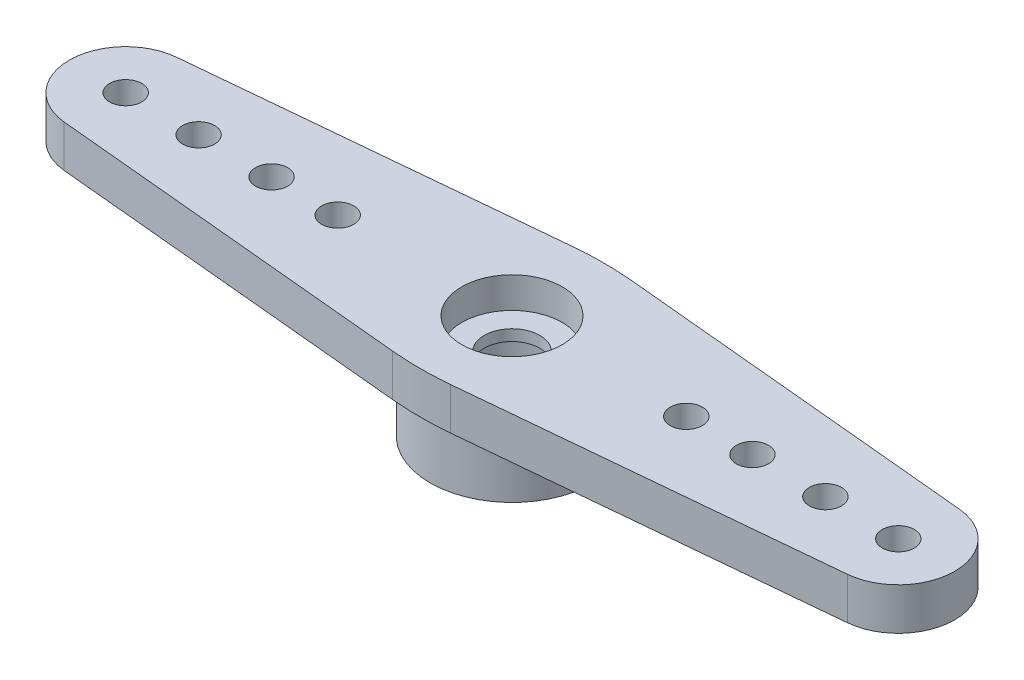
ISO-10303-21;
HEADER;
FILE_DESCRIPTION(('STEP AP214'),'2;1');
FILE_NAME('part.step','',(''),(''),'','','');
FILE_SCHEMA(('AUTOMOTIVE_DESIGN { 1 0 10303 214 1 1 1 1 }'));
ENDSEC;
DATA;
#1=APPLICATION_CONTEXT('core data for automotive mechanical design processes');
#2=APPLICATION_PROTOCOL_DEFINITION('international standard','automotive_design',2000,#1);
#3=PRODUCT_CONTEXT('',#1,'mechanical');
#4=PRODUCT('Part','Part','',(#3));
#5=PRODUCT_RELATED_PRODUCT_CATEGORY('part','',(#4));
#6=PRODUCT_DEFINITION_FORMATION('','',#4);
#7=PRODUCT_DEFINITION_CONTEXT('part definition',#1,'design');
#8=PRODUCT_DEFINITION('design','',#6,#7);
#9=PRODUCT_DEFINITION_SHAPE('','',#8);
#10=(LENGTH_UNIT() NAMED_UNIT(*) SI_UNIT(.MILLI.,.METRE.));
#11=(NAMED_UNIT(*) PLANE_ANGLE_UNIT() SI_UNIT($,.RADIAN.));
#12=(NAMED_UNIT(*) SI_UNIT($,.STERADIAN.) SOLID_ANGLE_UNIT());
#13=UNCERTAINTY_MEASURE_WITH_UNIT(LENGTH_MEASURE(1.E-05),#10,'distance_accuracy_value','');
#14=(GEOMETRIC_REPRESENTATION_CONTEXT(3) GLOBAL_UNCERTAINTY_ASSIGNED_CONTEXT((#13)) GLOBAL_UNIT_ASSIGNED_CONTEXT((#10,
#11,#12)) REPRESENTATION_CONTEXT('',''));
#15=CARTESIAN_POINT('',(0.,0.,0.));
#16=DIRECTION('',(0.,0.,1.));
#17=DIRECTION('',(1.,0.,0.));
#18=AXIS2_PLACEMENT_3D('',#15,#16,#17);
#19=CARTESIAN_POINT('',(0.,4.2672,0.));
#20=DIRECTION('',(0.,-1.,0.));
#21=DIRECTION('',(0.,0.,-1.));
#22=AXIS2_PLACEMENT_3D('',#19,#20,#21);
#23=CYLINDRICAL_SURFACE('',#22,1.143);
#24=CARTESIAN_POINT('',(0.,2.54,0.));
#25=DIRECTION('',(0.,1.,0.));
#26=DIRECTION('',(0.,0.,1.));
#27=AXIS2_PLACEMENT_3D('',#24,#25,#26);
#28=CIRCLE('',#27,1.143);
#29=CARTESIAN_POINT('',(0.,2.54,1.143));
#30=VERTEX_POINT('',#29);
#31=EDGE_CURVE('E198',#30,#30,#28,.T.);
#32=ORIENTED_EDGE('',*,*,#31,.F.);
#33=EDGE_LOOP('',(#32));
#34=FACE_BOUND('',#33,.T.);
#35=CARTESIAN_POINT('',(0.,2.9972,0.));
#36=DIRECTION('',(0.,1.,0.));
#37=DIRECTION('',(0.,0.,1.));
#38=AXIS2_PLACEMENT_3D('',#35,#36,#37);
#39=CIRCLE('',#38,1.143);
#40=CARTESIAN_POINT('',(0.,2.9972,1.143));
#41=VERTEX_POINT('',#40);
#42=EDGE_CURVE('E358',#41,#41,#39,.F.);
#43=ORIENTED_EDGE('',*,*,#42,.F.);
#44=EDGE_LOOP('',(#43));
#45=FACE_BOUND('',#44,.T.);
#46=ADVANCED_FACE('F36',(#34,#45),#23,.F.);
#47=CARTESIAN_POINT('',(0.,0.,0.));
#48=DIRECTION('',(0.,1.,0.));
#49=DIRECTION('',(0.,0.,1.));
#50=AXIS2_PLACEMENT_3D('',#47,#48,#49);
#51=PLANE('',#50);
#52=CARTESIAN_POINT('',(0.,0.,0.));
#53=DIRECTION('',(0.,1.,0.));
#54=DIRECTION('',(0.,0.,1.));
#55=AXIS2_PLACEMENT_3D('',#52,#53,#54);
#56=CIRCLE('',#55,3.3655);
#57=CARTESIAN_POINT('',(0.,0.,3.3655));
#58=VERTEX_POINT('',#57);
#59=EDGE_CURVE('E212',#58,#58,#56,.T.);
#60=ORIENTED_EDGE('',*,*,#59,.F.);
#61=EDGE_LOOP('',(#60));
#62=FACE_BOUND('',#61,.T.);
#63=CARTESIAN_POINT('',(0.,0.,0.));
#64=DIRECTION('',(0.,1.,0.));
#65=DIRECTION('',(0.,0.,1.));
#66=AXIS2_PLACEMENT_3D('',#63,#64,#65);
#67=CIRCLE('',#66,2.2352);
#68=CARTESIAN_POINT('',(0.,0.,2.2352));
#69=VERTEX_POINT('',#68);
#70=EDGE_CURVE('E209',#69,#69,#67,.T.);
#71=ORIENTED_EDGE('',*,*,#70,.T.);
#72=EDGE_LOOP('',(#71));
#73=FACE_BOUND('',#72,.T.);
#74=ADVANCED_FACE('F259',(#62,#73),#51,.F.);
#75=CARTESIAN_POINT('',(0.,2.54,0.));
#76=DIRECTION('',(0.,-1.,0.));
#77=DIRECTION('',(0.,0.,-1.));
#78=AXIS2_PLACEMENT_3D('',#75,#76,#77);
#79=CYLINDRICAL_SURFACE('',#78,3.3655);
#80=CARTESIAN_POINT('',(0.,2.54,0.));
#81=DIRECTION('',(0.,1.,0.));
#82=DIRECTION('',(0.,0.,1.));
#83=AXIS2_PLACEMENT_3D('',#80,#81,#82);
#84=CIRCLE('',#83,3.3655);
#85=CARTESIAN_POINT('',(0.,2.54,3.3655));
#86=VERTEX_POINT('',#85);
#87=EDGE_CURVE('E213',#86,#86,#84,.T.);
#88=ORIENTED_EDGE('',*,*,#87,.F.);
#89=EDGE_LOOP('',(#88));
#90=FACE_BOUND('',#89,.T.);
#91=ORIENTED_EDGE('',*,*,#59,.T.);
#92=EDGE_LOOP('',(#91));
#93=FACE_BOUND('',#92,.T.);
#94=ADVANCED_FACE('F265',(#90,#93),#79,.T.);
#95=CARTESIAN_POINT('',(0.,2.54,0.));
#96=DIRECTION('',(0.,-1.,0.));
#97=DIRECTION('',(0.,0.,-1.));
#98=AXIS2_PLACEMENT_3D('',#95,#96,#97);
#99=CYLINDRICAL_SURFACE('',#98,2.2352);
#100=CARTESIAN_POINT('',(0.,2.54,0.));
#101=DIRECTION('',(0.,1.,0.));
#102=DIRECTION('',(0.,0.,1.));
#103=AXIS2_PLACEMENT_3D('',#100,#101,#102);
#104=CIRCLE('',#103,2.2352);
#105=CARTESIAN_POINT('',(0.,2.54,2.2352));
#106=VERTEX_POINT('',#105);
#107=EDGE_CURVE('E121',#106,#106,#104,.T.);
#108=ORIENTED_EDGE('',*,*,#107,.T.);
#109=EDGE_LOOP('',(#108));
#110=FACE_BOUND('',#109,.T.);
#111=ORIENTED_EDGE('',*,*,#70,.F.);
#112=EDGE_LOOP('',(#111));
#113=FACE_BOUND('',#112,.T.);
#114=ADVANCED_FACE('F318',(#110,#113),#99,.F.);
#115=CARTESIAN_POINT('',(-29.0607200096115,2.54,0.));
#116=DIRECTION('',(0.,1.,0.));
#117=DIRECTION('',(0.,0.,1.));
#118=AXIS2_PLACEMENT_3D('',#115,#116,#117);
#119=PLANE('',#118);
#120=CARTESIAN_POINT('',(-9.8806,2.54,0.));
#121=DIRECTION('',(0.,1.,0.));
#122=DIRECTION('',(0.,0.,1.));
#123=AXIS2_PLACEMENT_3D('',#120,#121,#122);
#124=CIRCLE('',#123,0.6604);
#125=CARTESIAN_POINT('',(-9.8806,2.54,0.6604));
#126=VERTEX_POINT('',#125);
#127=EDGE_CURVE('E161',#126,#126,#124,.F.);
#128=ORIENTED_EDGE('',*,*,#127,.F.);
#129=EDGE_LOOP('',(#128));
#130=FACE_BOUND('',#129,.T.);
#131=DIRECTION('',(-0.995596740434201,0.,0.0937396950965555));
#132=VECTOR('',#131,1.);
#133=CARTESIAN_POINT('',(-29.162120546294,2.54,-1.07696151236052));
#134=LINE('',#133,#132);
#135=CARTESIAN_POINT('',(-1.19049412772623,2.54,-3.71060988156648));
#136=VERTEX_POINT('',#135);
#137=CARTESIAN_POINT('',(-16.09226517831,2.54,-2.30754434514137));
#138=VERTEX_POINT('',#137);
#139=EDGE_CURVE('E117',#136,#138,#134,.T.);
#140=ORIENTED_EDGE('',*,*,#139,.F.);
#141=CARTESIAN_POINT('',(0.,2.54,8.93346872194787));
#142=DIRECTION('',(0.,1.,0.));
#143=DIRECTION('',(0.,0.,1.));
#144=AXIS2_PLACEMENT_3D('',#141,#142,#143);
#145=CIRCLE('',#144,12.7);
#146=CARTESIAN_POINT('',(1.19049412772628,2.54,-3.71060988156648));
#147=VERTEX_POINT('',#146);
#148=EDGE_CURVE('E222',#136,#147,#145,.F.);
#149=ORIENTED_EDGE('',*,*,#148,.T.);
#150=DIRECTION('',(0.995596740434201,0.,0.0937396950965555));
#151=VECTOR('',#150,1.);
#152=CARTESIAN_POINT('',(-28.4485987983057,2.54,-6.50125736059801));
#153=LINE('',#152,#151);
#154=CARTESIAN_POINT('',(16.09226517831,2.54,-2.30754434514137));
#155=VERTEX_POINT('',#154);
#156=EDGE_CURVE('E175',#147,#155,#153,.T.);
#157=ORIENTED_EDGE('',*,*,#156,.T.);
#158=CARTESIAN_POINT('',(15.875,2.54,0.));
#159=DIRECTION('',(0.,1.,0.));
#160=DIRECTION('',(0.,0.,1.));
#161=AXIS2_PLACEMENT_3D('',#158,#159,#160);
#162=CIRCLE('',#161,2.31775);
#163=CARTESIAN_POINT('',(16.09226517831,2.54,2.30754434514137));
#164=VERTEX_POINT('',#163);
#165=EDGE_CURVE('E172',#164,#155,#162,.T.);
#166=ORIENTED_EDGE('',*,*,#165,.F.);
#167=DIRECTION('',(0.995596740434201,0.,-0.0937396950965555));
#168=VECTOR('',#167,1.);
#169=CARTESIAN_POINT('',(-28.4485987983057,2.54,6.50125736059801));
#170=LINE('',#169,#168);
#171=CARTESIAN_POINT('',(1.19049412772627,2.54,3.71060988156648));
#172=VERTEX_POINT('',#171);
#173=EDGE_CURVE('E170',#172,#164,#170,.T.);
#174=ORIENTED_EDGE('',*,*,#173,.F.);
#175=CARTESIAN_POINT('',(0.,2.54,-8.93346872194787));
#176=DIRECTION('',(0.,1.,0.));
#177=DIRECTION('',(0.,0.,1.));
#178=AXIS2_PLACEMENT_3D('',#175,#176,#177);
#179=CIRCLE('',#178,12.7);
#180=CARTESIAN_POINT('',(-1.19049412772624,2.54,3.71060988156648));
#181=VERTEX_POINT('',#180);
#182=EDGE_CURVE('E220',#172,#181,#179,.F.);
#183=ORIENTED_EDGE('',*,*,#182,.T.);
#184=DIRECTION('',(-0.995596740434201,0.,-0.0937396950965555));
#185=VECTOR('',#184,1.);
#186=CARTESIAN_POINT('',(-29.162120546294,2.54,1.07696151236052));
#187=LINE('',#186,#185);
#188=CARTESIAN_POINT('',(-16.09226517831,2.54,2.30754434514137));
#189=VERTEX_POINT('',#188);
#190=EDGE_CURVE('E168',#181,#189,#187,.T.);
#191=ORIENTED_EDGE('',*,*,#190,.T.);
#192=CARTESIAN_POINT('',(-15.875,2.54,0.));
#193=DIRECTION('',(0.,1.,0.));
#194=DIRECTION('',(0.,0.,1.));
#195=AXIS2_PLACEMENT_3D('',#192,#193,#194);
#196=CIRCLE('',#195,2.31775);
#197=EDGE_CURVE('E166',#189,#138,#196,.F.);
#198=ORIENTED_EDGE('',*,*,#197,.T.);
#199=EDGE_LOOP('',(#140,#149,#157,#166,#174,#183,#191,#198));
#200=FACE_BOUND('',#199,.T.);
#201=CARTESIAN_POINT('',(-7.1628,2.54,0.));
#202=DIRECTION('',(0.,1.,0.));
#203=DIRECTION('',(0.,0.,1.));
#204=AXIS2_PLACEMENT_3D('',#201,#202,#203);
#205=CIRCLE('',#204,0.6604);
#206=CARTESIAN_POINT('',(-7.1628,2.54,0.6604));
#207=VERTEX_POINT('',#206);
#208=EDGE_CURVE('E177',#207,#207,#205,.F.);
#209=ORIENTED_EDGE('',*,*,#208,.F.);
#210=EDGE_LOOP('',(#209));
#211=FACE_BOUND('',#210,.T.);
#212=CARTESIAN_POINT('',(-12.8778,2.54,0.));
#213=DIRECTION('',(0.,1.,0.));
#214=DIRECTION('',(0.,0.,1.));
#215=AXIS2_PLACEMENT_3D('',#212,#213,#214);
#216=CIRCLE('',#215,0.660399999999998);
#217=CARTESIAN_POINT('',(-12.8778,2.54,0.660399999999998));
#218=VERTEX_POINT('',#217);
#219=EDGE_CURVE('E180',#218,#218,#216,.F.);
#220=ORIENTED_EDGE('',*,*,#219,.F.);
#221=EDGE_LOOP('',(#220));
#222=FACE_BOUND('',#221,.T.);
#223=CARTESIAN_POINT('',(-15.875,2.54,0.));
#224=DIRECTION('',(0.,1.,0.));
#225=DIRECTION('',(0.,0.,1.));
#226=AXIS2_PLACEMENT_3D('',#223,#224,#225);
#227=CIRCLE('',#226,0.660399999999998);
#228=CARTESIAN_POINT('',(-15.875,2.54,0.660399999999998));
#229=VERTEX_POINT('',#228);
#230=EDGE_CURVE('E183',#229,#229,#227,.F.);
#231=ORIENTED_EDGE('',*,*,#230,.F.);
#232=EDGE_LOOP('',(#231));
#233=FACE_BOUND('',#232,.T.);
#234=CARTESIAN_POINT('',(12.8778,2.54,0.));
#235=DIRECTION('',(0.,1.,0.));
#236=DIRECTION('',(0.,0.,1.));
#237=AXIS2_PLACEMENT_3D('',#234,#235,#236);
#238=CIRCLE('',#237,0.660399999999998);
#239=CARTESIAN_POINT('',(12.8778,2.54,0.660399999999998));
#240=VERTEX_POINT('',#239);
#241=EDGE_CURVE('E186',#240,#240,#238,.T.);
#242=ORIENTED_EDGE('',*,*,#241,.T.);
#243=EDGE_LOOP('',(#242));
#244=FACE_BOUND('',#243,.T.);
#245=CARTESIAN_POINT('',(9.8806,2.54,0.));
#246=DIRECTION('',(0.,1.,0.));
#247=DIRECTION('',(0.,0.,1.));
#248=AXIS2_PLACEMENT_3D('',#245,#246,#247);
#249=CIRCLE('',#248,0.6604);
#250=CARTESIAN_POINT('',(9.8806,2.54,0.6604));
#251=VERTEX_POINT('',#250);
#252=EDGE_CURVE('E189',#251,#251,#249,.T.);
#253=ORIENTED_EDGE('',*,*,#252,.T.);
#254=EDGE_LOOP('',(#253));
#255=FACE_BOUND('',#254,.T.);
#256=CARTESIAN_POINT('',(7.1628,2.54,0.));
#257=DIRECTION('',(0.,1.,0.));
#258=DIRECTION('',(0.,0.,1.));
#259=AXIS2_PLACEMENT_3D('',#256,#257,#258);
#260=CIRCLE('',#259,0.6604);
#261=CARTESIAN_POINT('',(7.1628,2.54,0.6604));
#262=VERTEX_POINT('',#261);
#263=EDGE_CURVE('E192',#262,#262,#260,.T.);
#264=ORIENTED_EDGE('',*,*,#263,.T.);
#265=EDGE_LOOP('',(#264));
#266=FACE_BOUND('',#265,.T.);
#267=CARTESIAN_POINT('',(15.875,2.54,0.));
#268=DIRECTION('',(0.,1.,0.));
#269=DIRECTION('',(0.,0.,1.));
#270=AXIS2_PLACEMENT_3D('',#267,#268,#269);
#271=CIRCLE('',#270,0.660399999999998);
#272=CARTESIAN_POINT('',(15.875,2.54,0.660399999999998));
#273=VERTEX_POINT('',#272);
#274=EDGE_CURVE('E195',#273,#273,#271,.T.);
#275=ORIENTED_EDGE('',*,*,#274,.T.);
#276=EDGE_LOOP('',(#275));
#277=FACE_BOUND('',#276,.T.);
#278=ORIENTED_EDGE('',*,*,#87,.T.);
#279=EDGE_LOOP('',(#278));
#280=FACE_BOUND('',#279,.T.);
#281=ADVANCED_FACE('F236',(#130,#200,#211,#222,#233,#244,#255,#266,#277,#280),#119,.F.);
#282=CARTESIAN_POINT('',(-29.162120546294,4.2672,-1.07696151236052));
#283=DIRECTION('',(0.0937396950965555,0.,0.995596740434201));
#284=DIRECTION('',(0.995596740434201,0.,-0.0937396950965555));
#285=AXIS2_PLACEMENT_3D('',#282,#283,#284);
#286=PLANE('',#285);
#287=DIRECTION('',(-0.995596740434201,0.,0.0937396950965555));
#288=VECTOR('',#287,1.);
#289=CARTESIAN_POINT('',(-29.162120546294,4.2672,-1.07696151236052));
#290=LINE('',#289,#288);
#291=CARTESIAN_POINT('',(-1.19049412772623,4.2672,-3.71060988156648));
#292=VERTEX_POINT('',#291);
#293=CARTESIAN_POINT('',(-16.09226517831,4.2672,-2.30754434514137));
#294=VERTEX_POINT('',#293);
#295=EDGE_CURVE('E99',#292,#294,#290,.T.);
#296=ORIENTED_EDGE('',*,*,#295,.F.);
#297=DIRECTION('',(0.,-1.,0.));
#298=VECTOR('',#297,1.);
#299=CARTESIAN_POINT('',(-1.19049412772624,2.54,-3.71060988156648));
#300=LINE('',#299,#298);
#301=EDGE_CURVE('E216',#292,#136,#300,.T.);
#302=ORIENTED_EDGE('',*,*,#301,.T.);
#303=ORIENTED_EDGE('',*,*,#139,.T.);
#304=DIRECTION('',(0.,-1.,0.));
#305=VECTOR('',#304,1.);
#306=CARTESIAN_POINT('',(-16.09226517831,4.2672,-2.30754434514137));
#307=LINE('',#306,#305);
#308=EDGE_CURVE('E114',#294,#138,#307,.T.);
#309=ORIENTED_EDGE('',*,*,#308,.F.);
#310=EDGE_LOOP('',(#296,#302,#303,#309));
#311=FACE_BOUND('',#310,.T.);
#312=ADVANCED_FACE('F115',(#311),#286,.F.);
#313=CARTESIAN_POINT('',(-15.875,4.2672,0.));
#314=DIRECTION('',(0.,-1.,0.));
#315=DIRECTION('',(0.,0.,-1.));
#316=AXIS2_PLACEMENT_3D('',#313,#314,#315);
#317=CYLINDRICAL_SURFACE('',#316,2.31775);
#318=ORIENTED_EDGE('',*,*,#197,.F.);
#319=DIRECTION('',(0.,-1.,0.));
#320=VECTOR('',#319,1.);
#321=CARTESIAN_POINT('',(-16.09226517831,4.2672,2.30754434514137));
#322=LINE('',#321,#320);
#323=CARTESIAN_POINT('',(-16.09226517831,4.2672,2.30754434514137));
#324=VERTEX_POINT('',#323);
#325=EDGE_CURVE('E122',#324,#189,#322,.T.);
#326=ORIENTED_EDGE('',*,*,#325,.F.);
#327=CARTESIAN_POINT('',(-15.875,4.2672,0.));
#328=DIRECTION('',(0.,1.,0.));
#329=DIRECTION('',(0.,0.,1.));
#330=AXIS2_PLACEMENT_3D('',#327,#328,#329);
#331=CIRCLE('',#330,2.31775);
#332=EDGE_CURVE('E105',#324,#294,#331,.F.);
#333=ORIENTED_EDGE('',*,*,#332,.T.);
#334=ORIENTED_EDGE('',*,*,#308,.T.);
#335=EDGE_LOOP('',(#318,#326,#333,#334));
#336=FACE_BOUND('',#335,.T.);
#337=ADVANCED_FACE('F125',(#336),#317,.T.);
#338=CARTESIAN_POINT('',(-29.162120546294,4.2672,1.07696151236052));
#339=DIRECTION('',(-0.0937396950965555,0.,0.995596740434201));
#340=DIRECTION('',(0.995596740434201,0.,0.0937396950965555));
#341=AXIS2_PLACEMENT_3D('',#338,#339,#340);
#342=PLANE('',#341);
#343=ORIENTED_EDGE('',*,*,#190,.F.);
#344=DIRECTION('',(0.,-1.,0.));
#345=VECTOR('',#344,1.);
#346=CARTESIAN_POINT('',(-1.19049412772625,4.2672,3.71060988156648));
#347=LINE('',#346,#345);
#348=CARTESIAN_POINT('',(-1.19049412772624,4.2672,3.71060988156648));
#349=VERTEX_POINT('',#348);
#350=EDGE_CURVE('E11',#181,#349,#347,.F.);
#351=ORIENTED_EDGE('',*,*,#350,.T.);
#352=DIRECTION('',(-0.995596740434201,0.,-0.0937396950965555));
#353=VECTOR('',#352,1.);
#354=CARTESIAN_POINT('',(-29.162120546294,4.2672,1.07696151236052));
#355=LINE('',#354,#353);
#356=EDGE_CURVE('E127',#349,#324,#355,.T.);
#357=ORIENTED_EDGE('',*,*,#356,.T.);
#358=ORIENTED_EDGE('',*,*,#325,.T.);
#359=EDGE_LOOP('',(#343,#351,#357,#358));
#360=FACE_BOUND('',#359,.T.);
#361=ADVANCED_FACE('F247',(#360),#342,.T.);
#362=CARTESIAN_POINT('',(-28.4485987983057,4.2672,6.50125736059801));
#363=DIRECTION('',(-0.0937396950965555,0.,-0.995596740434201));
#364=DIRECTION('',(-0.995596740434201,0.,0.0937396950965555));
#365=AXIS2_PLACEMENT_3D('',#362,#363,#364);
#366=PLANE('',#365);
#367=DIRECTION('',(0.995596740434201,0.,-0.0937396950965555));
#368=VECTOR('',#367,1.);
#369=CARTESIAN_POINT('',(-28.4485987983057,4.2672,6.50125736059801));
#370=LINE('',#369,#368);
#371=CARTESIAN_POINT('',(1.19049412772627,4.2672,3.71060988156648));
#372=VERTEX_POINT('',#371);
#373=CARTESIAN_POINT('',(16.09226517831,4.2672,2.30754434514137));
#374=VERTEX_POINT('',#373);
#375=EDGE_CURVE('E129',#372,#374,#370,.T.);
#376=ORIENTED_EDGE('',*,*,#375,.F.);
#377=DIRECTION('',(0.,-1.,0.));
#378=VECTOR('',#377,1.);
#379=CARTESIAN_POINT('',(1.19049412772626,2.54,3.71060988156648));
#380=LINE('',#379,#378);
#381=EDGE_CURVE('E44',#372,#172,#380,.T.);
#382=ORIENTED_EDGE('',*,*,#381,.T.);
#383=ORIENTED_EDGE('',*,*,#173,.T.);
#384=DIRECTION('',(0.,-1.,0.));
#385=VECTOR('',#384,1.);
#386=CARTESIAN_POINT('',(16.09226517831,4.2672,2.30754434514137));
#387=LINE('',#386,#385);
#388=EDGE_CURVE('E203',#374,#164,#387,.T.);
#389=ORIENTED_EDGE('',*,*,#388,.F.);
#390=EDGE_LOOP('',(#376,#382,#383,#389));
#391=FACE_BOUND('',#390,.T.);
#392=ADVANCED_FACE('F231',(#391),#366,.F.);
#393=CARTESIAN_POINT('',(15.875,4.2672,0.));
#394=DIRECTION('',(0.,-1.,0.));
#395=DIRECTION('',(0.,0.,-1.));
#396=AXIS2_PLACEMENT_3D('',#393,#394,#395);
#397=CYLINDRICAL_SURFACE('',#396,2.31775);
#398=ORIENTED_EDGE('',*,*,#165,.T.);
#399=DIRECTION('',(0.,-1.,0.));
#400=VECTOR('',#399,1.);
#401=CARTESIAN_POINT('',(16.09226517831,4.2672,-2.30754434514137));
#402=LINE('',#401,#400);
#403=CARTESIAN_POINT('',(16.09226517831,4.2672,-2.30754434514137));
#404=VERTEX_POINT('',#403);
#405=EDGE_CURVE('E160',#404,#155,#402,.T.);
#406=ORIENTED_EDGE('',*,*,#405,.F.);
#407=CARTESIAN_POINT('',(15.875,4.2672,0.));
#408=DIRECTION('',(0.,1.,0.));
#409=DIRECTION('',(0.,0.,1.));
#410=AXIS2_PLACEMENT_3D('',#407,#408,#409);
#411=CIRCLE('',#410,2.31775);
#412=EDGE_CURVE('E134',#374,#404,#411,.T.);
#413=ORIENTED_EDGE('',*,*,#412,.F.);
#414=ORIENTED_EDGE('',*,*,#388,.T.);
#415=EDGE_LOOP('',(#398,#406,#413,#414));
#416=FACE_BOUND('',#415,.T.);
#417=ADVANCED_FACE('F241',(#416),#397,.T.);
#418=CARTESIAN_POINT('',(15.875,4.2672,0.));
#419=DIRECTION('',(0.,-1.,0.));
#420=DIRECTION('',(0.,0.,-1.));
#421=AXIS2_PLACEMENT_3D('',#418,#419,#420);
#422=CYLINDRICAL_SURFACE('',#421,0.660399999999998);
#423=CARTESIAN_POINT('',(15.875,4.2672,0.));
#424=DIRECTION('',(0.,1.,0.));
#425=DIRECTION('',(0.,0.,1.));
#426=AXIS2_PLACEMENT_3D('',#423,#424,#425);
#427=CIRCLE('',#426,0.660399999999998);
#428=CARTESIAN_POINT('',(15.875,4.2672,0.660399999999998));
#429=VERTEX_POINT('',#428);
#430=EDGE_CURVE('E157',#429,#429,#427,.T.);
#431=ORIENTED_EDGE('',*,*,#430,.T.);
#432=EDGE_LOOP('',(#431));
#433=FACE_BOUND('',#432,.T.);
#434=ORIENTED_EDGE('',*,*,#274,.F.);
#435=EDGE_LOOP('',(#434));
#436=FACE_BOUND('',#435,.T.);
#437=ADVANCED_FACE('F273',(#433,#436),#422,.F.);
#438=CARTESIAN_POINT('',(7.1628,4.2672,0.));
#439=DIRECTION('',(0.,-1.,0.));
#440=DIRECTION('',(0.,0.,-1.));
#441=AXIS2_PLACEMENT_3D('',#438,#439,#440);
#442=CYLINDRICAL_SURFACE('',#441,0.6604);
#443=CARTESIAN_POINT('',(7.1628,4.2672,0.));
#444=DIRECTION('',(0.,1.,0.));
#445=DIRECTION('',(0.,0.,1.));
#446=AXIS2_PLACEMENT_3D('',#443,#444,#445);
#447=CIRCLE('',#446,0.6604);
#448=CARTESIAN_POINT('',(7.1628,4.2672,0.6604));
#449=VERTEX_POINT('',#448);
#450=EDGE_CURVE('E154',#449,#449,#447,.T.);
#451=ORIENTED_EDGE('',*,*,#450,.T.);
#452=EDGE_LOOP('',(#451));
#453=FACE_BOUND('',#452,.T.);
#454=ORIENTED_EDGE('',*,*,#263,.F.);
#455=EDGE_LOOP('',(#454));
#456=FACE_BOUND('',#455,.T.);
#457=ADVANCED_FACE('F276',(#453,#456),#442,.F.);
#458=CARTESIAN_POINT('',(9.8806,4.2672,0.));
#459=DIRECTION('',(0.,-1.,0.));
#460=DIRECTION('',(0.,0.,-1.));
#461=AXIS2_PLACEMENT_3D('',#458,#459,#460);
#462=CYLINDRICAL_SURFACE('',#461,0.6604);
#463=CARTESIAN_POINT('',(9.8806,4.2672,0.));
#464=DIRECTION('',(0.,1.,0.));
#465=DIRECTION('',(0.,0.,1.));
#466=AXIS2_PLACEMENT_3D('',#463,#464,#465);
#467=CIRCLE('',#466,0.6604);
#468=CARTESIAN_POINT('',(9.8806,4.2672,0.6604));
#469=VERTEX_POINT('',#468);
#470=EDGE_CURVE('E151',#469,#469,#467,.T.);
#471=ORIENTED_EDGE('',*,*,#470,.T.);
#472=EDGE_LOOP('',(#471));
#473=FACE_BOUND('',#472,.T.);
#474=ORIENTED_EDGE('',*,*,#252,.F.);
#475=EDGE_LOOP('',(#474));
#476=FACE_BOUND('',#475,.T.);
#477=ADVANCED_FACE('F280',(#473,#476),#462,.F.);
#478=CARTESIAN_POINT('',(12.8778,4.2672,0.));
#479=DIRECTION('',(0.,-1.,0.));
#480=DIRECTION('',(0.,0.,-1.));
#481=AXIS2_PLACEMENT_3D('',#478,#479,#480);
#482=CYLINDRICAL_SURFACE('',#481,0.660399999999998);
#483=CARTESIAN_POINT('',(12.8778,4.2672,0.));
#484=DIRECTION('',(0.,1.,0.));
#485=DIRECTION('',(0.,0.,1.));
#486=AXIS2_PLACEMENT_3D('',#483,#484,#485);
#487=CIRCLE('',#486,0.660399999999998);
#488=CARTESIAN_POINT('',(12.8778,4.2672,0.660399999999998));
#489=VERTEX_POINT('',#488);
#490=EDGE_CURVE('E148',#489,#489,#487,.T.);
#491=ORIENTED_EDGE('',*,*,#490,.T.);
#492=EDGE_LOOP('',(#491));
#493=FACE_BOUND('',#492,.T.);
#494=ORIENTED_EDGE('',*,*,#241,.F.);
#495=EDGE_LOOP('',(#494));
#496=FACE_BOUND('',#495,.T.);
#497=ADVANCED_FACE('F284',(#493,#496),#482,.F.);
#498=CARTESIAN_POINT('',(-15.875,4.2672,0.));
#499=DIRECTION('',(0.,-1.,0.));
#500=DIRECTION('',(0.,0.,-1.));
#501=AXIS2_PLACEMENT_3D('',#498,#499,#500);
#502=CYLINDRICAL_SURFACE('',#501,0.660399999999998);
#503=CARTESIAN_POINT('',(-15.875,4.2672,0.));
#504=DIRECTION('',(0.,1.,0.));
#505=DIRECTION('',(0.,0.,1.));
#506=AXIS2_PLACEMENT_3D('',#503,#504,#505);
#507=CIRCLE('',#506,0.660399999999998);
#508=CARTESIAN_POINT('',(-15.875,4.2672,0.660399999999998));
#509=VERTEX_POINT('',#508);
#510=EDGE_CURVE('E145',#509,#509,#507,.F.);
#511=ORIENTED_EDGE('',*,*,#510,.F.);
#512=EDGE_LOOP('',(#511));
#513=FACE_BOUND('',#512,.T.);
#514=ORIENTED_EDGE('',*,*,#230,.T.);
#515=EDGE_LOOP('',(#514));
#516=FACE_BOUND('',#515,.T.);
#517=ADVANCED_FACE('F288',(#513,#516),#502,.F.);
#518=CARTESIAN_POINT('',(-12.8778,4.2672,0.));
#519=DIRECTION('',(0.,-1.,0.));
#520=DIRECTION('',(0.,0.,-1.));
#521=AXIS2_PLACEMENT_3D('',#518,#519,#520);
#522=CYLINDRICAL_SURFACE('',#521,0.660399999999998);
#523=CARTESIAN_POINT('',(-12.8778,4.2672,0.));
#524=DIRECTION('',(0.,1.,0.));
#525=DIRECTION('',(0.,0.,1.));
#526=AXIS2_PLACEMENT_3D('',#523,#524,#525);
#527=CIRCLE('',#526,0.660399999999998);
#528=CARTESIAN_POINT('',(-12.8778,4.2672,0.660399999999998));
#529=VERTEX_POINT('',#528);
#530=EDGE_CURVE('E142',#529,#529,#527,.F.);
#531=ORIENTED_EDGE('',*,*,#530,.F.);
#532=EDGE_LOOP('',(#531));
#533=FACE_BOUND('',#532,.T.);
#534=ORIENTED_EDGE('',*,*,#219,.T.);
#535=EDGE_LOOP('',(#534));
#536=FACE_BOUND('',#535,.T.);
#537=ADVANCED_FACE('F292',(#533,#536),#522,.F.);
#538=CARTESIAN_POINT('',(-7.1628,4.2672,0.));
#539=DIRECTION('',(0.,-1.,0.));
#540=DIRECTION('',(0.,0.,-1.));
#541=AXIS2_PLACEMENT_3D('',#538,#539,#540);
#542=CYLINDRICAL_SURFACE('',#541,0.6604);
#543=CARTESIAN_POINT('',(-7.1628,4.2672,0.));
#544=DIRECTION('',(0.,1.,0.));
#545=DIRECTION('',(0.,0.,1.));
#546=AXIS2_PLACEMENT_3D('',#543,#544,#545);
#547=CIRCLE('',#546,0.6604);
#548=CARTESIAN_POINT('',(-7.1628,4.2672,0.6604));
#549=VERTEX_POINT('',#548);
#550=EDGE_CURVE('E139',#549,#549,#547,.F.);
#551=ORIENTED_EDGE('',*,*,#550,.F.);
#552=EDGE_LOOP('',(#551));
#553=FACE_BOUND('',#552,.T.);
#554=ORIENTED_EDGE('',*,*,#208,.T.);
#555=EDGE_LOOP('',(#554));
#556=FACE_BOUND('',#555,.T.);
#557=ADVANCED_FACE('F296',(#553,#556),#542,.F.);
#558=CARTESIAN_POINT('',(-28.4485987983057,4.2672,-6.50125736059801));
#559=DIRECTION('',(0.0937396950965555,0.,-0.995596740434201));
#560=DIRECTION('',(-0.995596740434201,0.,-0.0937396950965555));
#561=AXIS2_PLACEMENT_3D('',#558,#559,#560);
#562=PLANE('',#561);
#563=ORIENTED_EDGE('',*,*,#156,.F.);
#564=DIRECTION('',(0.,-1.,0.));
#565=VECTOR('',#564,1.);
#566=CARTESIAN_POINT('',(1.19049412772627,4.2672,-3.71060988156648));
#567=LINE('',#566,#565);
#568=CARTESIAN_POINT('',(1.19049412772628,4.2672,-3.71060988156648));
#569=VERTEX_POINT('',#568);
#570=EDGE_CURVE('E224',#147,#569,#567,.F.);
#571=ORIENTED_EDGE('',*,*,#570,.T.);
#572=DIRECTION('',(0.995596740434201,0.,0.0937396950965555));
#573=VECTOR('',#572,1.);
#574=CARTESIAN_POINT('',(-28.4485987983057,4.2672,-6.50125736059801));
#575=LINE('',#574,#573);
#576=EDGE_CURVE('E137',#569,#404,#575,.T.);
#577=ORIENTED_EDGE('',*,*,#576,.T.);
#578=ORIENTED_EDGE('',*,*,#405,.T.);
#579=EDGE_LOOP('',(#563,#571,#577,#578));
#580=FACE_BOUND('',#579,.T.);
#581=ADVANCED_FACE('F300',(#580),#562,.T.);
#582=CARTESIAN_POINT('',(-9.8806,4.2672,0.));
#583=DIRECTION('',(0.,-1.,0.));
#584=DIRECTION('',(0.,0.,-1.));
#585=AXIS2_PLACEMENT_3D('',#582,#583,#584);
#586=CYLINDRICAL_SURFACE('',#585,0.6604);
#587=CARTESIAN_POINT('',(-9.8806,4.2672,0.));
#588=DIRECTION('',(0.,1.,0.));
#589=DIRECTION('',(0.,0.,1.));
#590=AXIS2_PLACEMENT_3D('',#587,#588,#589);
#591=CIRCLE('',#590,0.6604);
#592=CARTESIAN_POINT('',(-9.8806,4.2672,0.6604));
#593=VERTEX_POINT('',#592);
#594=EDGE_CURVE('E111',#593,#593,#591,.F.);
#595=ORIENTED_EDGE('',*,*,#594,.F.);
#596=EDGE_LOOP('',(#595));
#597=FACE_BOUND('',#596,.T.);
#598=ORIENTED_EDGE('',*,*,#127,.T.);
#599=EDGE_LOOP('',(#598));
#600=FACE_BOUND('',#599,.T.);
#601=ADVANCED_FACE('F304',(#597,#600),#586,.F.);
#602=CARTESIAN_POINT('',(-29.0607200096115,4.2672,0.));
#603=DIRECTION('',(0.,1.,0.));
#604=DIRECTION('',(0.,0.,1.));
#605=AXIS2_PLACEMENT_3D('',#602,#603,#604);
#606=PLANE('',#605);
#607=CARTESIAN_POINT('',(0.,4.2672,0.));
#608=DIRECTION('',(0.,1.,0.));
#609=DIRECTION('',(0.,0.,1.));
#610=AXIS2_PLACEMENT_3D('',#607,#608,#609);
#611=CIRCLE('',#610,2.06375);
#612=CARTESIAN_POINT('',(0.,4.2672,2.06375));
#613=VERTEX_POINT('',#612);
#614=EDGE_CURVE('E362',#613,#613,#611,.T.);
#615=ORIENTED_EDGE('',*,*,#614,.F.);
#616=EDGE_LOOP('',(#615));
#617=FACE_BOUND('',#616,.T.);
#618=ORIENTED_EDGE('',*,*,#594,.T.);
#619=EDGE_LOOP('',(#618));
#620=FACE_BOUND('',#619,.T.);
#621=ORIENTED_EDGE('',*,*,#576,.F.);
#622=CARTESIAN_POINT('',(0.,4.2672,8.93346872194787));
#623=DIRECTION('',(0.,1.,0.));
#624=DIRECTION('',(0.,0.,1.));
#625=AXIS2_PLACEMENT_3D('',#622,#623,#624);
#626=CIRCLE('',#625,12.7);
#627=EDGE_CURVE('E107',#569,#292,#626,.T.);
#628=ORIENTED_EDGE('',*,*,#627,.T.);
#629=ORIENTED_EDGE('',*,*,#295,.T.);
#630=ORIENTED_EDGE('',*,*,#332,.F.);
#631=ORIENTED_EDGE('',*,*,#356,.F.);
#632=CARTESIAN_POINT('',(0.,4.2672,-8.93346872194787));
#633=DIRECTION('',(0.,1.,0.));
#634=DIRECTION('',(0.,0.,1.));
#635=AXIS2_PLACEMENT_3D('',#632,#633,#634);
#636=CIRCLE('',#635,12.7);
#637=EDGE_CURVE('E51',#349,#372,#636,.T.);
#638=ORIENTED_EDGE('',*,*,#637,.T.);
#639=ORIENTED_EDGE('',*,*,#375,.T.);
#640=ORIENTED_EDGE('',*,*,#412,.T.);
#641=EDGE_LOOP('',(#621,#628,#629,#630,#631,#638,#639,#640));
#642=FACE_BOUND('',#641,.T.);
#643=ORIENTED_EDGE('',*,*,#550,.T.);
#644=EDGE_LOOP('',(#643));
#645=FACE_BOUND('',#644,.T.);
#646=ORIENTED_EDGE('',*,*,#530,.T.);
#647=EDGE_LOOP('',(#646));
#648=FACE_BOUND('',#647,.T.);
#649=ORIENTED_EDGE('',*,*,#510,.T.);
#650=EDGE_LOOP('',(#649));
#651=FACE_BOUND('',#650,.T.);
#652=ORIENTED_EDGE('',*,*,#490,.F.);
#653=EDGE_LOOP('',(#652));
#654=FACE_BOUND('',#653,.T.);
#655=ORIENTED_EDGE('',*,*,#470,.F.);
#656=EDGE_LOOP('',(#655));
#657=FACE_BOUND('',#656,.T.);
#658=ORIENTED_EDGE('',*,*,#450,.F.);
#659=EDGE_LOOP('',(#658));
#660=FACE_BOUND('',#659,.T.);
#661=ORIENTED_EDGE('',*,*,#430,.F.);
#662=EDGE_LOOP('',(#661));
#663=FACE_BOUND('',#662,.T.);
#664=ADVANCED_FACE('F102',(#617,#620,#642,#645,#648,#651,#654,#657,#660,#663),#606,.T.);
#665=ORIENTED_EDGE('',*,*,#107,.F.);
#666=EDGE_LOOP('',(#665));
#667=FACE_BOUND('',#666,.T.);
#668=ORIENTED_EDGE('',*,*,#31,.T.);
#669=EDGE_LOOP('',(#668));
#670=FACE_BOUND('',#669,.T.);
#671=ADVANCED_FACE('F257',(#667,#670),#119,.F.);
#672=CARTESIAN_POINT('',(0.,4.2672,8.93346872194787));
#673=DIRECTION('',(0.,1.,0.));
#674=DIRECTION('',(0.,0.,1.));
#675=AXIS2_PLACEMENT_3D('',#672,#673,#674);
#676=CYLINDRICAL_SURFACE('',#675,12.7);
#677=ORIENTED_EDGE('',*,*,#627,.F.);
#678=ORIENTED_EDGE('',*,*,#570,.F.);
#679=ORIENTED_EDGE('',*,*,#148,.F.);
#680=ORIENTED_EDGE('',*,*,#301,.F.);
#681=EDGE_LOOP('',(#677,#678,#679,#680));
#682=FACE_BOUND('',#681,.T.);
#683=ADVANCED_FACE('F246',(#682),#676,.T.);
#684=CARTESIAN_POINT('',(0.,4.2672,-8.93346872194787));
#685=DIRECTION('',(0.,1.,0.));
#686=DIRECTION('',(0.,0.,1.));
#687=AXIS2_PLACEMENT_3D('',#684,#685,#686);
#688=CYLINDRICAL_SURFACE('',#687,12.7);
#689=ORIENTED_EDGE('',*,*,#637,.F.);
#690=ORIENTED_EDGE('',*,*,#350,.F.);
#691=ORIENTED_EDGE('',*,*,#182,.F.);
#692=ORIENTED_EDGE('',*,*,#381,.F.);
#693=EDGE_LOOP('',(#689,#690,#691,#692));
#694=FACE_BOUND('',#693,.T.);
#695=ADVANCED_FACE('F38',(#694),#688,.T.);
#696=CARTESIAN_POINT('',(0.,2.9972,0.));
#697=DIRECTION('',(0.,1.,0.));
#698=DIRECTION('',(0.,0.,1.));
#699=AXIS2_PLACEMENT_3D('',#696,#697,#698);
#700=CYLINDRICAL_SURFACE('',#699,2.06375);
#701=CARTESIAN_POINT('',(0.,2.9972,0.));
#702=DIRECTION('',(0.,1.,0.));
#703=DIRECTION('',(0.,0.,1.));
#704=AXIS2_PLACEMENT_3D('',#701,#702,#703);
#705=CIRCLE('',#704,2.06375);
#706=CARTESIAN_POINT('',(0.,2.9972,2.06375));
#707=VERTEX_POINT('',#706);
#708=EDGE_CURVE('E164',#707,#707,#705,.T.);
#709=ORIENTED_EDGE('',*,*,#708,.F.);
#710=EDGE_LOOP('',(#709));
#711=FACE_BOUND('',#710,.T.);
#712=ORIENTED_EDGE('',*,*,#614,.T.);
#713=EDGE_LOOP('',(#712));
#714=FACE_BOUND('',#713,.T.);
#715=ADVANCED_FACE('F249',(#711,#714),#700,.F.);
#716=CARTESIAN_POINT('',(-28.8343368229583,2.9972,0.729493466455382));
#717=DIRECTION('',(0.,1.,0.));
#718=DIRECTION('',(0.,0.,1.));
#719=AXIS2_PLACEMENT_3D('',#716,#717,#718);
#720=PLANE('',#719);
#721=ORIENTED_EDGE('',*,*,#42,.T.);
#722=EDGE_LOOP('',(#721));
#723=FACE_BOUND('',#722,.T.);
#724=ORIENTED_EDGE('',*,*,#708,.T.);
#725=EDGE_LOOP('',(#724));
#726=FACE_BOUND('',#725,.T.);
#727=ADVANCED_FACE('F254',(#723,#726),#720,.T.);
#728=CLOSED_SHELL('',(#46,#74,#94,#114,#281,#312,#337,#361,#392,#417,#437,#457,#477,#497,#517,
#537,#557,#581,#601,#664,#671,#683,#695,#715,#727));
#729=MANIFOLD_SOLID_BREP('B2',#728);
#730=ADVANCED_BREP_SHAPE_REPRESENTATION('',(#18,#729),#14);
#731=SHAPE_DEFINITION_REPRESENTATION(#9,#730);
ENDSEC;
END-ISO-10303-21;
